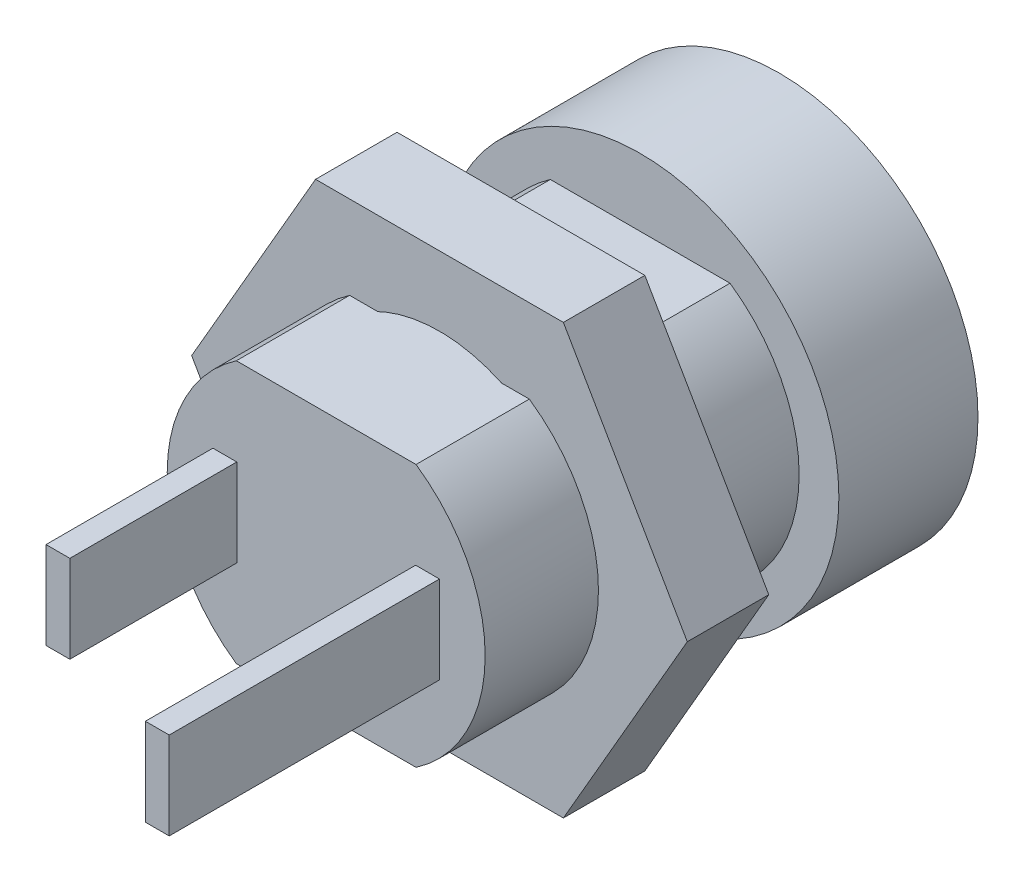
ISO-10303-21;
HEADER;
FILE_DESCRIPTION(('STEP AP214'),'2;1');
FILE_NAME('part.step','',(''),(''),'','','');
FILE_SCHEMA(('AUTOMOTIVE_DESIGN { 1 0 10303 214 1 1 1 1 }'));
ENDSEC;
DATA;
#1=APPLICATION_CONTEXT('core data for automotive mechanical design processes');
#2=APPLICATION_PROTOCOL_DEFINITION('international standard','automotive_design',2000,#1);
#3=PRODUCT_CONTEXT('',#1,'mechanical');
#4=PRODUCT('Part','Part','',(#3));
#5=PRODUCT_RELATED_PRODUCT_CATEGORY('part','',(#4));
#6=PRODUCT_DEFINITION_FORMATION('','',#4);
#7=PRODUCT_DEFINITION_CONTEXT('part definition',#1,'design');
#8=PRODUCT_DEFINITION('design','',#6,#7);
#9=PRODUCT_DEFINITION_SHAPE('','',#8);
#10=(LENGTH_UNIT() NAMED_UNIT(*) SI_UNIT(.MILLI.,.METRE.));
#11=(NAMED_UNIT(*) PLANE_ANGLE_UNIT() SI_UNIT($,.RADIAN.));
#12=(NAMED_UNIT(*) SI_UNIT($,.STERADIAN.) SOLID_ANGLE_UNIT());
#13=UNCERTAINTY_MEASURE_WITH_UNIT(LENGTH_MEASURE(1.E-05),#10,'distance_accuracy_value','');
#14=(GEOMETRIC_REPRESENTATION_CONTEXT(3) GLOBAL_UNCERTAINTY_ASSIGNED_CONTEXT((#13)) GLOBAL_UNIT_ASSIGNED_CONTEXT((#10,
#11,#12)) REPRESENTATION_CONTEXT('',''));
#15=CARTESIAN_POINT('',(0.,0.,0.));
#16=DIRECTION('',(0.,0.,1.));
#17=DIRECTION('',(1.,0.,0.));
#18=AXIS2_PLACEMENT_3D('',#15,#16,#17);
#19=CARTESIAN_POINT('',(0.,0.,-2.85));
#20=DIRECTION('',(0.,0.,1.));
#21=DIRECTION('',(1.,0.,0.));
#22=AXIS2_PLACEMENT_3D('',#19,#20,#21);
#23=PLANE('',#22);
#24=DIRECTION('',(-0.5,-0.866025403784439,0.));
#25=VECTOR('',#24,1.);
#26=CARTESIAN_POINT('',(-3.11769145362398,5.4,-2.85));
#27=LINE('',#26,#25);
#28=CARTESIAN_POINT('',(-3.11769145362398,5.4,-2.85));
#29=VERTEX_POINT('',#28);
#30=CARTESIAN_POINT('',(-6.23538290724796,0.,-2.85));
#31=VERTEX_POINT('',#30);
#32=EDGE_CURVE('E146',#29,#31,#27,.T.);
#33=ORIENTED_EDGE('',*,*,#32,.T.);
#34=DIRECTION('',(0.5,-0.866025403784438,0.));
#35=VECTOR('',#34,1.);
#36=CARTESIAN_POINT('',(-6.23538290724796,0.,-2.85));
#37=LINE('',#36,#35);
#38=CARTESIAN_POINT('',(-3.11769145362398,-5.4,-2.85));
#39=VERTEX_POINT('',#38);
#40=EDGE_CURVE('E104',#31,#39,#37,.T.);
#41=ORIENTED_EDGE('',*,*,#40,.T.);
#42=DIRECTION('',(1.,0.,0.));
#43=VECTOR('',#42,1.);
#44=CARTESIAN_POINT('',(-3.11769145362398,-5.4,-2.85));
#45=LINE('',#44,#43);
#46=CARTESIAN_POINT('',(3.11769145362398,-5.4,-2.85));
#47=VERTEX_POINT('',#46);
#48=EDGE_CURVE('E117',#39,#47,#45,.T.);
#49=ORIENTED_EDGE('',*,*,#48,.T.);
#50=DIRECTION('',(0.5,0.866025403784439,0.));
#51=VECTOR('',#50,1.);
#52=CARTESIAN_POINT('',(3.11769145362398,-5.4,-2.85));
#53=LINE('',#52,#51);
#54=CARTESIAN_POINT('',(6.23538290724796,0.,-2.85));
#55=VERTEX_POINT('',#54);
#56=EDGE_CURVE('E111',#47,#55,#53,.T.);
#57=ORIENTED_EDGE('',*,*,#56,.T.);
#58=DIRECTION('',(-0.5,0.866025403784439,0.));
#59=VECTOR('',#58,1.);
#60=CARTESIAN_POINT('',(6.23538290724796,0.,-2.85));
#61=LINE('',#60,#59);
#62=CARTESIAN_POINT('',(3.11769145362398,5.4,-2.85));
#63=VERTEX_POINT('',#62);
#64=EDGE_CURVE('E115',#55,#63,#61,.T.);
#65=ORIENTED_EDGE('',*,*,#64,.T.);
#66=DIRECTION('',(-1.,0.,0.));
#67=VECTOR('',#66,1.);
#68=CARTESIAN_POINT('',(3.11769145362398,5.4,-2.85));
#69=LINE('',#68,#67);
#70=EDGE_CURVE('E67',#63,#29,#69,.T.);
#71=ORIENTED_EDGE('',*,*,#70,.T.);
#72=EDGE_LOOP('',(#33,#41,#49,#57,#65,#71));
#73=FACE_BOUND('',#72,.T.);
#74=CARTESIAN_POINT('',(0.,0.,-2.85));
#75=DIRECTION('',(0.,0.,1.));
#76=DIRECTION('',(1.,0.,0.));
#77=AXIS2_PLACEMENT_3D('',#74,#75,#76);
#78=CIRCLE('',#77,3.65);
#79=CARTESIAN_POINT('',(3.65,0.,-2.85));
#80=VERTEX_POINT('',#79);
#81=EDGE_CURVE('E139',#80,#80,#78,.T.);
#82=ORIENTED_EDGE('',*,*,#81,.F.);
#83=EDGE_LOOP('',(#82));
#84=FACE_BOUND('',#83,.T.);
#85=ADVANCED_FACE('F50',(#73,#84),#23,.T.);
#86=CARTESIAN_POINT('',(0.,0.,-4.9));
#87=DIRECTION('',(0.,0.,1.));
#88=DIRECTION('',(1.,0.,0.));
#89=AXIS2_PLACEMENT_3D('',#86,#87,#88);
#90=PLANE('',#89);
#91=DIRECTION('',(-0.5,-0.866025403784439,0.));
#92=VECTOR('',#91,1.);
#93=CARTESIAN_POINT('',(-3.11769145362398,5.4,-4.9));
#94=LINE('',#93,#92);
#95=CARTESIAN_POINT('',(-3.11769145362398,5.4,-4.9));
#96=VERTEX_POINT('',#95);
#97=CARTESIAN_POINT('',(-6.23538290724796,0.,-4.9));
#98=VERTEX_POINT('',#97);
#99=EDGE_CURVE('E135',#96,#98,#94,.T.);
#100=ORIENTED_EDGE('',*,*,#99,.F.);
#101=DIRECTION('',(-1.,0.,0.));
#102=VECTOR('',#101,1.);
#103=CARTESIAN_POINT('',(3.11769145362398,5.4,-4.9));
#104=LINE('',#103,#102);
#105=CARTESIAN_POINT('',(3.11769145362398,5.4,-4.9));
#106=VERTEX_POINT('',#105);
#107=EDGE_CURVE('E96',#106,#96,#104,.T.);
#108=ORIENTED_EDGE('',*,*,#107,.F.);
#109=DIRECTION('',(-0.5,0.866025403784439,0.));
#110=VECTOR('',#109,1.);
#111=CARTESIAN_POINT('',(6.23538290724796,0.,-4.9));
#112=LINE('',#111,#110);
#113=CARTESIAN_POINT('',(6.23538290724796,0.,-4.9));
#114=VERTEX_POINT('',#113);
#115=EDGE_CURVE('E90',#114,#106,#112,.T.);
#116=ORIENTED_EDGE('',*,*,#115,.F.);
#117=DIRECTION('',(0.5,0.866025403784439,0.));
#118=VECTOR('',#117,1.);
#119=CARTESIAN_POINT('',(3.11769145362398,-5.4,-4.9));
#120=LINE('',#119,#118);
#121=CARTESIAN_POINT('',(3.11769145362398,-5.4,-4.9));
#122=VERTEX_POINT('',#121);
#123=EDGE_CURVE('E125',#122,#114,#120,.T.);
#124=ORIENTED_EDGE('',*,*,#123,.F.);
#125=DIRECTION('',(1.,0.,0.));
#126=VECTOR('',#125,1.);
#127=CARTESIAN_POINT('',(-3.11769145362398,-5.4,-4.9));
#128=LINE('',#127,#126);
#129=CARTESIAN_POINT('',(-3.11769145362398,-5.4,-4.9));
#130=VERTEX_POINT('',#129);
#131=EDGE_CURVE('E141',#130,#122,#128,.T.);
#132=ORIENTED_EDGE('',*,*,#131,.F.);
#133=DIRECTION('',(0.5,-0.866025403784438,0.));
#134=VECTOR('',#133,1.);
#135=CARTESIAN_POINT('',(-6.23538290724796,0.,-4.9));
#136=LINE('',#135,#134);
#137=EDGE_CURVE('E138',#98,#130,#136,.T.);
#138=ORIENTED_EDGE('',*,*,#137,.F.);
#139=EDGE_LOOP('',(#100,#108,#116,#124,#132,#138));
#140=FACE_BOUND('',#139,.T.);
#141=CARTESIAN_POINT('',(0.,0.,-4.9));
#142=DIRECTION('',(0.,0.,1.));
#143=DIRECTION('',(1.,0.,0.));
#144=AXIS2_PLACEMENT_3D('',#141,#142,#143);
#145=CIRCLE('',#144,3.65);
#146=CARTESIAN_POINT('',(3.65,0.,-4.9));
#147=VERTEX_POINT('',#146);
#148=EDGE_CURVE('E239',#147,#147,#145,.T.);
#149=ORIENTED_EDGE('',*,*,#148,.T.);
#150=EDGE_LOOP('',(#149));
#151=FACE_BOUND('',#150,.T.);
#152=ADVANCED_FACE('F155',(#140,#151),#90,.F.);
#153=CARTESIAN_POINT('',(-3.11769145362398,5.4,-2.85));
#154=DIRECTION('',(0.866025403784439,-0.5,0.));
#155=DIRECTION('',(0.5,0.866025403784439,0.));
#156=AXIS2_PLACEMENT_3D('',#153,#154,#155);
#157=PLANE('',#156);
#158=ORIENTED_EDGE('',*,*,#99,.T.);
#159=DIRECTION('',(0.,0.,-1.));
#160=VECTOR('',#159,1.);
#161=CARTESIAN_POINT('',(-6.23538290724796,0.,-2.85));
#162=LINE('',#161,#160);
#163=EDGE_CURVE('E13',#31,#98,#162,.T.);
#164=ORIENTED_EDGE('',*,*,#163,.F.);
#165=ORIENTED_EDGE('',*,*,#32,.F.);
#166=DIRECTION('',(0.,0.,-1.));
#167=VECTOR('',#166,1.);
#168=CARTESIAN_POINT('',(-3.11769145362398,5.4,-2.85));
#169=LINE('',#168,#167);
#170=EDGE_CURVE('E131',#29,#96,#169,.T.);
#171=ORIENTED_EDGE('',*,*,#170,.T.);
#172=EDGE_LOOP('',(#158,#164,#165,#171));
#173=FACE_BOUND('',#172,.T.);
#174=ADVANCED_FACE('F52',(#173),#157,.F.);
#175=CARTESIAN_POINT('',(-6.23538290724796,0.,-2.85));
#176=DIRECTION('',(0.866025403784438,0.5,0.));
#177=DIRECTION('',(-0.5,0.866025403784438,0.));
#178=AXIS2_PLACEMENT_3D('',#175,#176,#177);
#179=PLANE('',#178);
#180=ORIENTED_EDGE('',*,*,#137,.T.);
#181=DIRECTION('',(0.,0.,-1.));
#182=VECTOR('',#181,1.);
#183=CARTESIAN_POINT('',(-3.11769145362398,-5.4,-2.85));
#184=LINE('',#183,#182);
#185=EDGE_CURVE('E59',#39,#130,#184,.T.);
#186=ORIENTED_EDGE('',*,*,#185,.F.);
#187=ORIENTED_EDGE('',*,*,#40,.F.);
#188=ORIENTED_EDGE('',*,*,#163,.T.);
#189=EDGE_LOOP('',(#180,#186,#187,#188));
#190=FACE_BOUND('',#189,.T.);
#191=ADVANCED_FACE('F180',(#190),#179,.F.);
#192=CARTESIAN_POINT('',(-3.11769145362398,-5.4,-2.85));
#193=DIRECTION('',(0.,1.,0.));
#194=DIRECTION('',(0.,0.,1.));
#195=AXIS2_PLACEMENT_3D('',#192,#193,#194);
#196=PLANE('',#195);
#197=ORIENTED_EDGE('',*,*,#131,.T.);
#198=DIRECTION('',(0.,0.,-1.));
#199=VECTOR('',#198,1.);
#200=CARTESIAN_POINT('',(3.11769145362398,-5.4,-2.85));
#201=LINE('',#200,#199);
#202=EDGE_CURVE('E126',#47,#122,#201,.T.);
#203=ORIENTED_EDGE('',*,*,#202,.F.);
#204=ORIENTED_EDGE('',*,*,#48,.F.);
#205=ORIENTED_EDGE('',*,*,#185,.T.);
#206=EDGE_LOOP('',(#197,#203,#204,#205));
#207=FACE_BOUND('',#206,.T.);
#208=ADVANCED_FACE('F152',(#207),#196,.F.);
#209=CARTESIAN_POINT('',(3.11769145362398,-5.4,-2.85));
#210=DIRECTION('',(-0.866025403784439,0.5,0.));
#211=DIRECTION('',(-0.5,-0.866025403784439,0.));
#212=AXIS2_PLACEMENT_3D('',#209,#210,#211);
#213=PLANE('',#212);
#214=ORIENTED_EDGE('',*,*,#123,.T.);
#215=DIRECTION('',(0.,0.,-1.));
#216=VECTOR('',#215,1.);
#217=CARTESIAN_POINT('',(6.23538290724796,0.,-2.85));
#218=LINE('',#217,#216);
#219=EDGE_CURVE('E122',#55,#114,#218,.T.);
#220=ORIENTED_EDGE('',*,*,#219,.F.);
#221=ORIENTED_EDGE('',*,*,#56,.F.);
#222=ORIENTED_EDGE('',*,*,#202,.T.);
#223=EDGE_LOOP('',(#214,#220,#221,#222));
#224=FACE_BOUND('',#223,.T.);
#225=ADVANCED_FACE('F123',(#224),#213,.F.);
#226=CARTESIAN_POINT('',(6.23538290724796,0.,-2.85));
#227=DIRECTION('',(-0.866025403784439,-0.5,0.));
#228=DIRECTION('',(0.5,-0.866025403784439,0.));
#229=AXIS2_PLACEMENT_3D('',#226,#227,#228);
#230=PLANE('',#229);
#231=ORIENTED_EDGE('',*,*,#115,.T.);
#232=DIRECTION('',(0.,0.,-1.));
#233=VECTOR('',#232,1.);
#234=CARTESIAN_POINT('',(3.11769145362398,5.4,-2.85));
#235=LINE('',#234,#233);
#236=EDGE_CURVE('E127',#63,#106,#235,.T.);
#237=ORIENTED_EDGE('',*,*,#236,.F.);
#238=ORIENTED_EDGE('',*,*,#64,.F.);
#239=ORIENTED_EDGE('',*,*,#219,.T.);
#240=EDGE_LOOP('',(#231,#237,#238,#239));
#241=FACE_BOUND('',#240,.T.);
#242=ADVANCED_FACE('F129',(#241),#230,.F.);
#243=CARTESIAN_POINT('',(3.11769145362398,5.4,-2.85));
#244=DIRECTION('',(0.,-1.,0.));
#245=DIRECTION('',(0.,0.,-1.));
#246=AXIS2_PLACEMENT_3D('',#243,#244,#245);
#247=PLANE('',#246);
#248=ORIENTED_EDGE('',*,*,#107,.T.);
#249=ORIENTED_EDGE('',*,*,#170,.F.);
#250=ORIENTED_EDGE('',*,*,#70,.F.);
#251=ORIENTED_EDGE('',*,*,#236,.T.);
#252=EDGE_LOOP('',(#248,#249,#250,#251));
#253=FACE_BOUND('',#252,.T.);
#254=ADVANCED_FACE('F160',(#253),#247,.F.);
#255=CARTESIAN_POINT('',(0.,0.,-2.85));
#256=DIRECTION('',(0.,0.,-1.));
#257=DIRECTION('',(-1.,0.,0.));
#258=AXIS2_PLACEMENT_3D('',#255,#256,#257);
#259=CYLINDRICAL_SURFACE('',#258,3.65);
#260=ORIENTED_EDGE('',*,*,#81,.T.);
#261=EDGE_LOOP('',(#260));
#262=FACE_BOUND('',#261,.T.);
#263=ORIENTED_EDGE('',*,*,#148,.F.);
#264=EDGE_LOOP('',(#263));
#265=FACE_BOUND('',#264,.T.);
#266=ADVANCED_FACE('F162',(#262,#265),#259,.F.);
#267=CLOSED_SHELL('',(#85,#152,#174,#191,#208,#225,#242,#254,#266));
#268=MANIFOLD_SOLID_BREP('B2',#267);
#269=CARTESIAN_POINT('',(0.,4.,0.));
#270=DIRECTION('',(0.,0.,-1.));
#271=DIRECTION('',(-1.,0.,0.));
#272=AXIS2_PLACEMENT_3D('',#269,#270,#271);
#273=PLANE('',#272);
#274=DIRECTION('',(0.,-1.,0.));
#275=VECTOR('',#274,1.);
#276=CARTESIAN_POINT('',(-2.85,-1.1,0.));
#277=LINE('',#276,#275);
#278=CARTESIAN_POINT('',(-2.85,1.1,0.));
#279=VERTEX_POINT('',#278);
#280=CARTESIAN_POINT('',(-2.85,-1.1,0.));
#281=VERTEX_POINT('',#280);
#282=EDGE_CURVE('E433',#279,#281,#277,.T.);
#283=ORIENTED_EDGE('',*,*,#282,.F.);
#284=DIRECTION('',(-1.,0.,0.));
#285=VECTOR('',#284,1.);
#286=CARTESIAN_POINT('',(-2.25,1.1,0.));
#287=LINE('',#286,#285);
#288=CARTESIAN_POINT('',(-2.25,1.1,0.));
#289=VERTEX_POINT('',#288);
#290=EDGE_CURVE('E438',#289,#279,#287,.T.);
#291=ORIENTED_EDGE('',*,*,#290,.F.);
#292=DIRECTION('',(0.,1.,0.));
#293=VECTOR('',#292,1.);
#294=CARTESIAN_POINT('',(-2.25,-1.1,0.));
#295=LINE('',#294,#293);
#296=CARTESIAN_POINT('',(-2.25,-1.1,0.));
#297=VERTEX_POINT('',#296);
#298=EDGE_CURVE('E450',#297,#289,#295,.T.);
#299=ORIENTED_EDGE('',*,*,#298,.F.);
#300=DIRECTION('',(1.,0.,0.));
#301=VECTOR('',#300,1.);
#302=CARTESIAN_POINT('',(-2.25,-1.1,0.));
#303=LINE('',#302,#301);
#304=EDGE_CURVE('E447',#281,#297,#303,.T.);
#305=ORIENTED_EDGE('',*,*,#304,.F.);
#306=EDGE_LOOP('',(#283,#291,#299,#305));
#307=FACE_BOUND('',#306,.T.);
#308=DIRECTION('',(0.,-1.,0.));
#309=VECTOR('',#308,1.);
#310=CARTESIAN_POINT('',(2.25,-1.1,0.));
#311=LINE('',#310,#309);
#312=CARTESIAN_POINT('',(2.25,1.1,0.));
#313=VERTEX_POINT('',#312);
#314=CARTESIAN_POINT('',(2.25,-1.1,0.));
#315=VERTEX_POINT('',#314);
#316=EDGE_CURVE('E409',#313,#315,#311,.T.);
#317=ORIENTED_EDGE('',*,*,#316,.F.);
#318=DIRECTION('',(-1.,0.,0.));
#319=VECTOR('',#318,1.);
#320=CARTESIAN_POINT('',(2.85,1.1,0.));
#321=LINE('',#320,#319);
#322=CARTESIAN_POINT('',(2.85,1.1,0.));
#323=VERTEX_POINT('',#322);
#324=EDGE_CURVE('E418',#323,#313,#321,.T.);
#325=ORIENTED_EDGE('',*,*,#324,.F.);
#326=DIRECTION('',(0.,1.,0.));
#327=VECTOR('',#326,1.);
#328=CARTESIAN_POINT('',(2.85,-1.1,0.));
#329=LINE('',#328,#327);
#330=CARTESIAN_POINT('',(2.85,-1.1,0.));
#331=VERTEX_POINT('',#330);
#332=EDGE_CURVE('E415',#331,#323,#329,.T.);
#333=ORIENTED_EDGE('',*,*,#332,.F.);
#334=DIRECTION('',(1.,0.,0.));
#335=VECTOR('',#334,1.);
#336=CARTESIAN_POINT('',(2.85,-1.1,0.));
#337=LINE('',#336,#335);
#338=EDGE_CURVE('E412',#315,#331,#337,.T.);
#339=ORIENTED_EDGE('',*,*,#338,.F.);
#340=EDGE_LOOP('',(#317,#325,#333,#339));
#341=FACE_BOUND('',#340,.T.);
#342=DIRECTION('',(-1.,0.,0.));
#343=VECTOR('',#342,1.);
#344=CARTESIAN_POINT('',(4.,3.3,0.));
#345=LINE('',#344,#343);
#346=CARTESIAN_POINT('',(2.26053091109146,3.3,0.));
#347=VERTEX_POINT('',#346);
#348=CARTESIAN_POINT('',(-2.26053091109146,3.3,0.));
#349=VERTEX_POINT('',#348);
#350=EDGE_CURVE('E374',#347,#349,#345,.T.);
#351=ORIENTED_EDGE('',*,*,#350,.T.);
#352=CARTESIAN_POINT('',(0.,0.,0.));
#353=DIRECTION('',(0.,0.,1.));
#354=DIRECTION('',(1.,0.,0.));
#355=AXIS2_PLACEMENT_3D('',#352,#353,#354);
#356=CIRCLE('',#355,4.);
#357=CARTESIAN_POINT('',(-2.26053091109146,-3.3,0.));
#358=VERTEX_POINT('',#357);
#359=EDGE_CURVE('E342',#349,#358,#356,.T.);
#360=ORIENTED_EDGE('',*,*,#359,.T.);
#361=DIRECTION('',(1.,0.,0.));
#362=VECTOR('',#361,1.);
#363=CARTESIAN_POINT('',(4.,-3.3,0.));
#364=LINE('',#363,#362);
#365=CARTESIAN_POINT('',(2.26053091109146,-3.3,0.));
#366=VERTEX_POINT('',#365);
#367=EDGE_CURVE('E338',#358,#366,#364,.T.);
#368=ORIENTED_EDGE('',*,*,#367,.T.);
#369=EDGE_CURVE('E348',#366,#347,#356,.T.);
#370=ORIENTED_EDGE('',*,*,#369,.T.);
#371=EDGE_LOOP('',(#351,#360,#368,#370));
#372=FACE_BOUND('',#371,.T.);
#373=ADVANCED_FACE('F246',(#307,#341,#372),#273,.F.);
#374=CARTESIAN_POINT('',(0.,0.,0.));
#375=DIRECTION('',(0.,0.,1.));
#376=DIRECTION('',(1.,0.,0.));
#377=AXIS2_PLACEMENT_3D('',#374,#375,#376);
#378=CYLINDRICAL_SURFACE('',#377,4.);
#379=CARTESIAN_POINT('',(0.,0.,-7.9));
#380=DIRECTION('',(0.,0.,1.));
#381=DIRECTION('',(1.,0.,0.));
#382=AXIS2_PLACEMENT_3D('',#379,#380,#381);
#383=CIRCLE('',#382,4.);
#384=CARTESIAN_POINT('',(-2.26053091109146,3.3,-7.9));
#385=VERTEX_POINT('',#384);
#386=CARTESIAN_POINT('',(-2.26053091109146,-3.3,-7.9));
#387=VERTEX_POINT('',#386);
#388=EDGE_CURVE('E261',#385,#387,#383,.T.);
#389=ORIENTED_EDGE('',*,*,#388,.T.);
#390=DIRECTION('',(0.,0.,1.));
#391=VECTOR('',#390,1.);
#392=CARTESIAN_POINT('',(-2.26053091109146,-3.3,0.));
#393=LINE('',#392,#391);
#394=EDGE_CURVE('E363',#358,#387,#393,.F.);
#395=ORIENTED_EDGE('',*,*,#394,.F.);
#396=ORIENTED_EDGE('',*,*,#359,.F.);
#397=DIRECTION('',(0.,0.,1.));
#398=VECTOR('',#397,1.);
#399=CARTESIAN_POINT('',(-2.26053091109146,3.3,0.));
#400=LINE('',#399,#398);
#401=EDGE_CURVE('E48',#385,#349,#400,.T.);
#402=ORIENTED_EDGE('',*,*,#401,.F.);
#403=EDGE_LOOP('',(#389,#395,#396,#402));
#404=FACE_BOUND('',#403,.T.);
#405=ADVANCED_FACE('F341',(#404),#378,.T.);
#406=DIRECTION('',(0.,0.,1.));
#407=VECTOR('',#406,1.);
#408=CARTESIAN_POINT('',(2.26053091109146,-3.3,0.));
#409=LINE('',#408,#407);
#410=CARTESIAN_POINT('',(2.26053091109146,-3.3,-7.9));
#411=VERTEX_POINT('',#410);
#412=EDGE_CURVE('E365',#411,#366,#409,.T.);
#413=ORIENTED_EDGE('',*,*,#412,.F.);
#414=CARTESIAN_POINT('',(2.26053091109146,3.3,-7.9));
#415=VERTEX_POINT('',#414);
#416=EDGE_CURVE('E347',#411,#415,#383,.T.);
#417=ORIENTED_EDGE('',*,*,#416,.T.);
#418=DIRECTION('',(0.,0.,1.));
#419=VECTOR('',#418,1.);
#420=CARTESIAN_POINT('',(2.26053091109146,3.3,0.));
#421=LINE('',#420,#419);
#422=EDGE_CURVE('E254',#347,#415,#421,.F.);
#423=ORIENTED_EDGE('',*,*,#422,.F.);
#424=ORIENTED_EDGE('',*,*,#369,.F.);
#425=EDGE_LOOP('',(#413,#417,#423,#424));
#426=FACE_BOUND('',#425,.T.);
#427=ADVANCED_FACE('F500',(#426),#378,.T.);
#428=CARTESIAN_POINT('',(0.,0.,0.));
#429=DIRECTION('',(0.,0.,1.));
#430=DIRECTION('',(1.,0.,0.));
#431=AXIS2_PLACEMENT_3D('',#428,#429,#430);
#432=CYLINDRICAL_SURFACE('',#431,5.);
#433=CARTESIAN_POINT('',(0.,0.,-7.9));
#434=DIRECTION('',(0.,0.,1.));
#435=DIRECTION('',(1.,0.,0.));
#436=AXIS2_PLACEMENT_3D('',#433,#434,#435);
#437=CIRCLE('',#436,5.);
#438=CARTESIAN_POINT('',(5.,0.,-7.9));
#439=VERTEX_POINT('',#438);
#440=EDGE_CURVE('E350',#439,#439,#437,.T.);
#441=ORIENTED_EDGE('',*,*,#440,.F.);
#442=EDGE_LOOP('',(#441));
#443=FACE_BOUND('',#442,.T.);
#444=CARTESIAN_POINT('',(0.,0.,-11.4));
#445=DIRECTION('',(0.,0.,-1.));
#446=DIRECTION('',(-1.,0.,0.));
#447=AXIS2_PLACEMENT_3D('',#444,#445,#446);
#448=CIRCLE('',#447,5.);
#449=CARTESIAN_POINT('',(-5.,0.,-11.4));
#450=VERTEX_POINT('',#449);
#451=EDGE_CURVE('E382',#450,#450,#448,.T.);
#452=ORIENTED_EDGE('',*,*,#451,.F.);
#453=EDGE_LOOP('',(#452));
#454=FACE_BOUND('',#453,.T.);
#455=ADVANCED_FACE('F507',(#443,#454),#432,.T.);
#456=CARTESIAN_POINT('',(0.,5.,-7.9));
#457=DIRECTION('',(0.,0.,-1.));
#458=DIRECTION('',(-1.,0.,0.));
#459=AXIS2_PLACEMENT_3D('',#456,#457,#458);
#460=PLANE('',#459);
#461=DIRECTION('',(1.,0.,0.));
#462=VECTOR('',#461,1.);
#463=CARTESIAN_POINT('',(4.,-3.3,-7.9));
#464=LINE('',#463,#462);
#465=EDGE_CURVE('E337',#387,#411,#464,.T.);
#466=ORIENTED_EDGE('',*,*,#465,.F.);
#467=ORIENTED_EDGE('',*,*,#388,.F.);
#468=DIRECTION('',(-1.,0.,0.));
#469=VECTOR('',#468,1.);
#470=CARTESIAN_POINT('',(4.,3.3,-7.9));
#471=LINE('',#470,#469);
#472=EDGE_CURVE('E268',#415,#385,#471,.T.);
#473=ORIENTED_EDGE('',*,*,#472,.F.);
#474=ORIENTED_EDGE('',*,*,#416,.F.);
#475=EDGE_LOOP('',(#466,#467,#473,#474));
#476=FACE_BOUND('',#475,.T.);
#477=ORIENTED_EDGE('',*,*,#440,.T.);
#478=EDGE_LOOP('',(#477));
#479=FACE_BOUND('',#478,.T.);
#480=ADVANCED_FACE('F343',(#476,#479),#460,.F.);
#481=CARTESIAN_POINT('',(-2.85,-1.1,4.2));
#482=DIRECTION('',(1.,0.,0.));
#483=DIRECTION('',(0.,0.,-1.));
#484=AXIS2_PLACEMENT_3D('',#481,#482,#483);
#485=PLANE('',#484);
#486=ORIENTED_EDGE('',*,*,#282,.T.);
#487=DIRECTION('',(0.,0.,-1.));
#488=VECTOR('',#487,1.);
#489=CARTESIAN_POINT('',(-2.85,-1.1,4.2));
#490=LINE('',#489,#488);
#491=CARTESIAN_POINT('',(-2.85,-1.1,4.2));
#492=VERTEX_POINT('',#491);
#493=EDGE_CURVE('E462',#492,#281,#490,.T.);
#494=ORIENTED_EDGE('',*,*,#493,.F.);
#495=DIRECTION('',(0.,-1.,0.));
#496=VECTOR('',#495,1.);
#497=CARTESIAN_POINT('',(-2.85,-1.1,4.2));
#498=LINE('',#497,#496);
#499=CARTESIAN_POINT('',(-2.85,1.1,4.2));
#500=VERTEX_POINT('',#499);
#501=EDGE_CURVE('E434',#500,#492,#498,.T.);
#502=ORIENTED_EDGE('',*,*,#501,.F.);
#503=DIRECTION('',(0.,0.,-1.));
#504=VECTOR('',#503,1.);
#505=CARTESIAN_POINT('',(-2.85,1.1,4.2));
#506=LINE('',#505,#504);
#507=EDGE_CURVE('E444',#500,#279,#506,.T.);
#508=ORIENTED_EDGE('',*,*,#507,.T.);
#509=EDGE_LOOP('',(#486,#494,#502,#508));
#510=FACE_BOUND('',#509,.T.);
#511=ADVANCED_FACE('F470',(#510),#485,.F.);
#512=CARTESIAN_POINT('',(-2.25,-1.1,4.2));
#513=DIRECTION('',(0.,1.,0.));
#514=DIRECTION('',(0.,0.,1.));
#515=AXIS2_PLACEMENT_3D('',#512,#513,#514);
#516=PLANE('',#515);
#517=ORIENTED_EDGE('',*,*,#304,.T.);
#518=DIRECTION('',(0.,0.,-1.));
#519=VECTOR('',#518,1.);
#520=CARTESIAN_POINT('',(-2.25,-1.1,4.2));
#521=LINE('',#520,#519);
#522=CARTESIAN_POINT('',(-2.25,-1.1,4.2));
#523=VERTEX_POINT('',#522);
#524=EDGE_CURVE('E460',#523,#297,#521,.T.);
#525=ORIENTED_EDGE('',*,*,#524,.F.);
#526=DIRECTION('',(1.,0.,0.));
#527=VECTOR('',#526,1.);
#528=CARTESIAN_POINT('',(-2.25,-1.1,4.2));
#529=LINE('',#528,#527);
#530=EDGE_CURVE('E437',#492,#523,#529,.T.);
#531=ORIENTED_EDGE('',*,*,#530,.F.);
#532=ORIENTED_EDGE('',*,*,#493,.T.);
#533=EDGE_LOOP('',(#517,#525,#531,#532));
#534=FACE_BOUND('',#533,.T.);
#535=ADVANCED_FACE('F466',(#534),#516,.F.);
#536=CARTESIAN_POINT('',(-2.25,-1.1,4.2));
#537=DIRECTION('',(-1.,0.,0.));
#538=DIRECTION('',(0.,-1.,0.));
#539=AXIS2_PLACEMENT_3D('',#536,#537,#538);
#540=PLANE('',#539);
#541=ORIENTED_EDGE('',*,*,#298,.T.);
#542=DIRECTION('',(0.,0.,-1.));
#543=VECTOR('',#542,1.);
#544=CARTESIAN_POINT('',(-2.25,1.1,4.2));
#545=LINE('',#544,#543);
#546=CARTESIAN_POINT('',(-2.25,1.1,4.2));
#547=VERTEX_POINT('',#546);
#548=EDGE_CURVE('E457',#547,#289,#545,.T.);
#549=ORIENTED_EDGE('',*,*,#548,.F.);
#550=DIRECTION('',(0.,1.,0.));
#551=VECTOR('',#550,1.);
#552=CARTESIAN_POINT('',(-2.25,-1.1,4.2));
#553=LINE('',#552,#551);
#554=EDGE_CURVE('E440',#523,#547,#553,.T.);
#555=ORIENTED_EDGE('',*,*,#554,.F.);
#556=ORIENTED_EDGE('',*,*,#524,.T.);
#557=EDGE_LOOP('',(#541,#549,#555,#556));
#558=FACE_BOUND('',#557,.T.);
#559=ADVANCED_FACE('F480',(#558),#540,.F.);
#560=CARTESIAN_POINT('',(-2.25,1.1,4.2));
#561=DIRECTION('',(0.,-1.,0.));
#562=DIRECTION('',(0.,0.,-1.));
#563=AXIS2_PLACEMENT_3D('',#560,#561,#562);
#564=PLANE('',#563);
#565=ORIENTED_EDGE('',*,*,#290,.T.);
#566=ORIENTED_EDGE('',*,*,#507,.F.);
#567=DIRECTION('',(-1.,0.,0.));
#568=VECTOR('',#567,1.);
#569=CARTESIAN_POINT('',(-2.25,1.1,4.2));
#570=LINE('',#569,#568);
#571=EDGE_CURVE('E442',#547,#500,#570,.T.);
#572=ORIENTED_EDGE('',*,*,#571,.F.);
#573=ORIENTED_EDGE('',*,*,#548,.T.);
#574=EDGE_LOOP('',(#565,#566,#572,#573));
#575=FACE_BOUND('',#574,.T.);
#576=ADVANCED_FACE('F475',(#575),#564,.F.);
#577=CARTESIAN_POINT('',(0.,0.,4.2));
#578=DIRECTION('',(0.,0.,1.));
#579=DIRECTION('',(1.,0.,0.));
#580=AXIS2_PLACEMENT_3D('',#577,#578,#579);
#581=PLANE('',#580);
#582=ORIENTED_EDGE('',*,*,#501,.T.);
#583=ORIENTED_EDGE('',*,*,#530,.T.);
#584=ORIENTED_EDGE('',*,*,#554,.T.);
#585=ORIENTED_EDGE('',*,*,#571,.T.);
#586=EDGE_LOOP('',(#582,#583,#584,#585));
#587=FACE_BOUND('',#586,.T.);
#588=ADVANCED_FACE('F482',(#587),#581,.T.);
#589=CARTESIAN_POINT('',(2.25,-1.1,4.2));
#590=DIRECTION('',(1.,0.,0.));
#591=DIRECTION('',(0.,1.,0.));
#592=AXIS2_PLACEMENT_3D('',#589,#590,#591);
#593=PLANE('',#592);
#594=ORIENTED_EDGE('',*,*,#316,.T.);
#595=DIRECTION('',(0.,0.,-1.));
#596=VECTOR('',#595,1.);
#597=CARTESIAN_POINT('',(2.25,-1.1,4.2));
#598=LINE('',#597,#596);
#599=CARTESIAN_POINT('',(2.25,-1.1,6.8));
#600=VERTEX_POINT('',#599);
#601=EDGE_CURVE('E430',#600,#315,#598,.T.);
#602=ORIENTED_EDGE('',*,*,#601,.F.);
#603=DIRECTION('',(0.,-1.,0.));
#604=VECTOR('',#603,1.);
#605=CARTESIAN_POINT('',(2.25,1.1,6.8));
#606=LINE('',#605,#604);
#607=CARTESIAN_POINT('',(2.25,1.1,6.8));
#608=VERTEX_POINT('',#607);
#609=EDGE_CURVE('E400',#608,#600,#606,.T.);
#610=ORIENTED_EDGE('',*,*,#609,.F.);
#611=DIRECTION('',(0.,0.,-1.));
#612=VECTOR('',#611,1.);
#613=CARTESIAN_POINT('',(2.25,1.1,4.2));
#614=LINE('',#613,#612);
#615=EDGE_CURVE('E421',#608,#313,#614,.T.);
#616=ORIENTED_EDGE('',*,*,#615,.T.);
#617=EDGE_LOOP('',(#594,#602,#610,#616));
#618=FACE_BOUND('',#617,.T.);
#619=ADVANCED_FACE('F484',(#618),#593,.F.);
#620=CARTESIAN_POINT('',(2.85,-1.1,4.2));
#621=DIRECTION('',(0.,1.,0.));
#622=DIRECTION('',(0.,0.,1.));
#623=AXIS2_PLACEMENT_3D('',#620,#621,#622);
#624=PLANE('',#623);
#625=ORIENTED_EDGE('',*,*,#338,.T.);
#626=DIRECTION('',(0.,0.,-1.));
#627=VECTOR('',#626,1.);
#628=CARTESIAN_POINT('',(2.85,-1.1,4.2));
#629=LINE('',#628,#627);
#630=CARTESIAN_POINT('',(2.85,-1.1,6.8));
#631=VERTEX_POINT('',#630);
#632=EDGE_CURVE('E427',#631,#331,#629,.T.);
#633=ORIENTED_EDGE('',*,*,#632,.F.);
#634=DIRECTION('',(1.,0.,0.));
#635=VECTOR('',#634,1.);
#636=CARTESIAN_POINT('',(2.25,-1.1,6.8));
#637=LINE('',#636,#635);
#638=EDGE_CURVE('E403',#600,#631,#637,.T.);
#639=ORIENTED_EDGE('',*,*,#638,.F.);
#640=ORIENTED_EDGE('',*,*,#601,.T.);
#641=EDGE_LOOP('',(#625,#633,#639,#640));
#642=FACE_BOUND('',#641,.T.);
#643=ADVANCED_FACE('F490',(#642),#624,.F.);
#644=CARTESIAN_POINT('',(2.85,-1.1,4.2));
#645=DIRECTION('',(-1.,0.,0.));
#646=DIRECTION('',(0.,0.,1.));
#647=AXIS2_PLACEMENT_3D('',#644,#645,#646);
#648=PLANE('',#647);
#649=ORIENTED_EDGE('',*,*,#332,.T.);
#650=DIRECTION('',(0.,0.,-1.));
#651=VECTOR('',#650,1.);
#652=CARTESIAN_POINT('',(2.85,1.1,4.2));
#653=LINE('',#652,#651);
#654=CARTESIAN_POINT('',(2.85,1.1,6.8));
#655=VERTEX_POINT('',#654);
#656=EDGE_CURVE('E424',#655,#323,#653,.T.);
#657=ORIENTED_EDGE('',*,*,#656,.F.);
#658=DIRECTION('',(0.,1.,0.));
#659=VECTOR('',#658,1.);
#660=CARTESIAN_POINT('',(2.85,-1.1,6.8));
#661=LINE('',#660,#659);
#662=EDGE_CURVE('E406',#631,#655,#661,.T.);
#663=ORIENTED_EDGE('',*,*,#662,.F.);
#664=ORIENTED_EDGE('',*,*,#632,.T.);
#665=EDGE_LOOP('',(#649,#657,#663,#664));
#666=FACE_BOUND('',#665,.T.);
#667=ADVANCED_FACE('F559',(#666),#648,.F.);
#668=CARTESIAN_POINT('',(2.85,1.1,4.2));
#669=DIRECTION('',(0.,-1.,0.));
#670=DIRECTION('',(0.,0.,-1.));
#671=AXIS2_PLACEMENT_3D('',#668,#669,#670);
#672=PLANE('',#671);
#673=ORIENTED_EDGE('',*,*,#324,.T.);
#674=ORIENTED_EDGE('',*,*,#615,.F.);
#675=DIRECTION('',(-1.,0.,0.));
#676=VECTOR('',#675,1.);
#677=CARTESIAN_POINT('',(2.85,1.1,6.8));
#678=LINE('',#677,#676);
#679=EDGE_CURVE('E395',#655,#608,#678,.T.);
#680=ORIENTED_EDGE('',*,*,#679,.F.);
#681=ORIENTED_EDGE('',*,*,#656,.T.);
#682=EDGE_LOOP('',(#673,#674,#680,#681));
#683=FACE_BOUND('',#682,.T.);
#684=ADVANCED_FACE('F555',(#683),#672,.F.);
#685=CARTESIAN_POINT('',(0.,0.,6.8));
#686=DIRECTION('',(0.,0.,1.));
#687=DIRECTION('',(1.,0.,0.));
#688=AXIS2_PLACEMENT_3D('',#685,#686,#687);
#689=PLANE('',#688);
#690=ORIENTED_EDGE('',*,*,#679,.T.);
#691=ORIENTED_EDGE('',*,*,#609,.T.);
#692=ORIENTED_EDGE('',*,*,#638,.T.);
#693=ORIENTED_EDGE('',*,*,#662,.T.);
#694=EDGE_LOOP('',(#690,#691,#692,#693));
#695=FACE_BOUND('',#694,.T.);
#696=ADVANCED_FACE('F543',(#695),#689,.T.);
#697=CARTESIAN_POINT('',(0.,0.,-11.4));
#698=DIRECTION('',(0.,0.,-1.));
#699=DIRECTION('',(-1.,0.,0.));
#700=AXIS2_PLACEMENT_3D('',#697,#698,#699);
#701=PLANE('',#700);
#702=CARTESIAN_POINT('',(0.,0.,-11.4));
#703=DIRECTION('',(0.,0.,-1.));
#704=DIRECTION('',(-1.,0.,0.));
#705=AXIS2_PLACEMENT_3D('',#702,#703,#704);
#706=CIRCLE('',#705,4.45);
#707=CARTESIAN_POINT('',(-4.45,0.,-11.4));
#708=VERTEX_POINT('',#707);
#709=EDGE_CURVE('E379',#708,#708,#706,.T.);
#710=ORIENTED_EDGE('',*,*,#709,.F.);
#711=EDGE_LOOP('',(#710));
#712=FACE_BOUND('',#711,.T.);
#713=ORIENTED_EDGE('',*,*,#451,.T.);
#714=EDGE_LOOP('',(#713));
#715=FACE_BOUND('',#714,.T.);
#716=ADVANCED_FACE('F535',(#712,#715),#701,.T.);
#717=CARTESIAN_POINT('',(0.,0.,-11.4));
#718=DIRECTION('',(0.,0.,-1.));
#719=DIRECTION('',(-1.,0.,0.));
#720=AXIS2_PLACEMENT_3D('',#717,#718,#719);
#721=CYLINDRICAL_SURFACE('',#720,4.45);
#722=CARTESIAN_POINT('',(0.,0.,-11.5));
#723=DIRECTION('',(0.,0.,1.));
#724=DIRECTION('',(1.,0.,0.));
#725=AXIS2_PLACEMENT_3D('',#722,#723,#724);
#726=CIRCLE('',#725,4.45);
#727=CARTESIAN_POINT('',(4.45,0.,-11.5));
#728=VERTEX_POINT('',#727);
#729=EDGE_CURVE('E360',#728,#728,#726,.T.);
#730=ORIENTED_EDGE('',*,*,#729,.T.);
#731=EDGE_LOOP('',(#730));
#732=FACE_BOUND('',#731,.T.);
#733=ORIENTED_EDGE('',*,*,#709,.T.);
#734=EDGE_LOOP('',(#733));
#735=FACE_BOUND('',#734,.T.);
#736=ADVANCED_FACE('F527',(#732,#735),#721,.T.);
#737=CARTESIAN_POINT('',(0.,0.,-11.9));
#738=DIRECTION('',(0.,0.,1.));
#739=DIRECTION('',(1.,0.,0.));
#740=AXIS2_PLACEMENT_3D('',#737,#738,#739);
#741=PLANE('',#740);
#742=CARTESIAN_POINT('',(0.,0.,-11.9));
#743=DIRECTION('',(0.,0.,-1.));
#744=DIRECTION('',(-1.,0.,0.));
#745=AXIS2_PLACEMENT_3D('',#742,#743,#744);
#746=CIRCLE('',#745,1.);
#747=CARTESIAN_POINT('',(-1.,0.,-11.9));
#748=VERTEX_POINT('',#747);
#749=EDGE_CURVE('E385',#748,#748,#746,.T.);
#750=ORIENTED_EDGE('',*,*,#749,.T.);
#751=EDGE_LOOP('',(#750));
#752=FACE_BOUND('',#751,.T.);
#753=ADVANCED_FACE('F514',(#752),#741,.F.);
#754=CARTESIAN_POINT('',(0.,0.,-6.9));
#755=DIRECTION('',(0.,0.,-1.));
#756=DIRECTION('',(-1.,0.,0.));
#757=AXIS2_PLACEMENT_3D('',#754,#755,#756);
#758=CYLINDRICAL_SURFACE('',#757,1.);
#759=CARTESIAN_POINT('',(0.,0.,-6.9));
#760=DIRECTION('',(0.,0.,-1.));
#761=DIRECTION('',(-1.,0.,0.));
#762=AXIS2_PLACEMENT_3D('',#759,#760,#761);
#763=CIRCLE('',#762,1.);
#764=CARTESIAN_POINT('',(-1.,0.,-6.9));
#765=VERTEX_POINT('',#764);
#766=EDGE_CURVE('E386',#765,#765,#763,.T.);
#767=ORIENTED_EDGE('',*,*,#766,.T.);
#768=EDGE_LOOP('',(#767));
#769=FACE_BOUND('',#768,.T.);
#770=ORIENTED_EDGE('',*,*,#749,.F.);
#771=EDGE_LOOP('',(#770));
#772=FACE_BOUND('',#771,.T.);
#773=ADVANCED_FACE('F526',(#769,#772),#758,.T.);
#774=CARTESIAN_POINT('',(0.,0.,-6.9));
#775=DIRECTION('',(0.,0.,-1.));
#776=DIRECTION('',(-1.,0.,0.));
#777=AXIS2_PLACEMENT_3D('',#774,#775,#776);
#778=PLANE('',#777);
#779=ORIENTED_EDGE('',*,*,#766,.F.);
#780=EDGE_LOOP('',(#779));
#781=FACE_BOUND('',#780,.T.);
#782=CARTESIAN_POINT('',(0.,0.,-6.9));
#783=DIRECTION('',(0.,0.,-1.));
#784=DIRECTION('',(-1.,0.,0.));
#785=AXIS2_PLACEMENT_3D('',#782,#783,#784);
#786=CIRCLE('',#785,2.75);
#787=CARTESIAN_POINT('',(-2.75,0.,-6.9));
#788=VERTEX_POINT('',#787);
#789=EDGE_CURVE('E392',#788,#788,#786,.T.);
#790=ORIENTED_EDGE('',*,*,#789,.T.);
#791=EDGE_LOOP('',(#790));
#792=FACE_BOUND('',#791,.T.);
#793=ADVANCED_FACE('F521',(#781,#792),#778,.T.);
#794=CARTESIAN_POINT('',(0.,0.,-6.9));
#795=DIRECTION('',(0.,0.,-1.));
#796=DIRECTION('',(-1.,0.,0.));
#797=AXIS2_PLACEMENT_3D('',#794,#795,#796);
#798=CYLINDRICAL_SURFACE('',#797,2.75);
#799=ORIENTED_EDGE('',*,*,#789,.F.);
#800=EDGE_LOOP('',(#799));
#801=FACE_BOUND('',#800,.T.);
#802=CARTESIAN_POINT('',(0.,0.,-11.9));
#803=DIRECTION('',(0.,0.,-1.));
#804=DIRECTION('',(-1.,0.,0.));
#805=AXIS2_PLACEMENT_3D('',#802,#803,#804);
#806=CIRCLE('',#805,2.75);
#807=CARTESIAN_POINT('',(-2.75,0.,-11.9));
#808=VERTEX_POINT('',#807);
#809=EDGE_CURVE('E389',#808,#808,#806,.T.);
#810=ORIENTED_EDGE('',*,*,#809,.T.);
#811=EDGE_LOOP('',(#810));
#812=FACE_BOUND('',#811,.T.);
#813=ADVANCED_FACE('F512',(#801,#812),#798,.F.);
#814=CARTESIAN_POINT('',(0.,0.,-11.9));
#815=DIRECTION('',(0.,0.,1.));
#816=DIRECTION('',(1.,0.,0.));
#817=AXIS2_PLACEMENT_3D('',#814,#815,#816);
#818=CIRCLE('',#817,4.05);
#819=CARTESIAN_POINT('',(4.05,0.,-11.9));
#820=VERTEX_POINT('',#819);
#821=EDGE_CURVE('E357',#820,#820,#818,.F.);
#822=ORIENTED_EDGE('',*,*,#821,.T.);
#823=EDGE_LOOP('',(#822));
#824=FACE_BOUND('',#823,.T.);
#825=ORIENTED_EDGE('',*,*,#809,.F.);
#826=EDGE_LOOP('',(#825));
#827=FACE_BOUND('',#826,.T.);
#828=ADVANCED_FACE('F510',(#824,#827),#741,.F.);
#829=CARTESIAN_POINT('',(0.,0.,-11.9));
#830=DIRECTION('',(0.,0.,1.));
#831=DIRECTION('',(1.,0.,0.));
#832=AXIS2_PLACEMENT_3D('',#829,#830,#831);
#833=CONICAL_SURFACE('',#832,4.05,0.785398163397447);
#834=ORIENTED_EDGE('',*,*,#729,.F.);
#835=EDGE_LOOP('',(#834));
#836=FACE_BOUND('',#835,.T.);
#837=ORIENTED_EDGE('',*,*,#821,.F.);
#838=EDGE_LOOP('',(#837));
#839=FACE_BOUND('',#838,.T.);
#840=ADVANCED_FACE('F248',(#836,#839),#833,.T.);
#841=CARTESIAN_POINT('',(4.,-3.3,-22.7769395664574));
#842=DIRECTION('',(0.,-1.,0.));
#843=DIRECTION('',(1.,0.,0.));
#844=AXIS2_PLACEMENT_3D('',#841,#842,#843);
#845=PLANE('',#844);
#846=ORIENTED_EDGE('',*,*,#412,.T.);
#847=ORIENTED_EDGE('',*,*,#367,.F.);
#848=ORIENTED_EDGE('',*,*,#394,.T.);
#849=ORIENTED_EDGE('',*,*,#465,.T.);
#850=EDGE_LOOP('',(#846,#847,#848,#849));
#851=FACE_BOUND('',#850,.T.);
#852=ADVANCED_FACE('F371',(#851),#845,.T.);
#853=CARTESIAN_POINT('',(4.,3.3,-22.7769395664574));
#854=DIRECTION('',(0.,1.,0.));
#855=DIRECTION('',(-1.,0.,0.));
#856=AXIS2_PLACEMENT_3D('',#853,#854,#855);
#857=PLANE('',#856);
#858=ORIENTED_EDGE('',*,*,#401,.T.);
#859=ORIENTED_EDGE('',*,*,#350,.F.);
#860=ORIENTED_EDGE('',*,*,#422,.T.);
#861=ORIENTED_EDGE('',*,*,#472,.T.);
#862=EDGE_LOOP('',(#858,#859,#860,#861));
#863=FACE_BOUND('',#862,.T.);
#864=ADVANCED_FACE('F333',(#863),#857,.T.);
#865=CLOSED_SHELL('',(#373,#405,#427,#455,#480,#511,#535,#559,#576,#588,#619,#643,#667,#684,
#696,#716,#736,#753,#773,#793,#813,#828,#840,#852,#864));
#866=MANIFOLD_SOLID_BREP('B7',#865);
#867=ADVANCED_BREP_SHAPE_REPRESENTATION('',(#18,#268,#866),#14);
#868=SHAPE_DEFINITION_REPRESENTATION(#9,#867);
ENDSEC;
END-ISO-10303-21;
